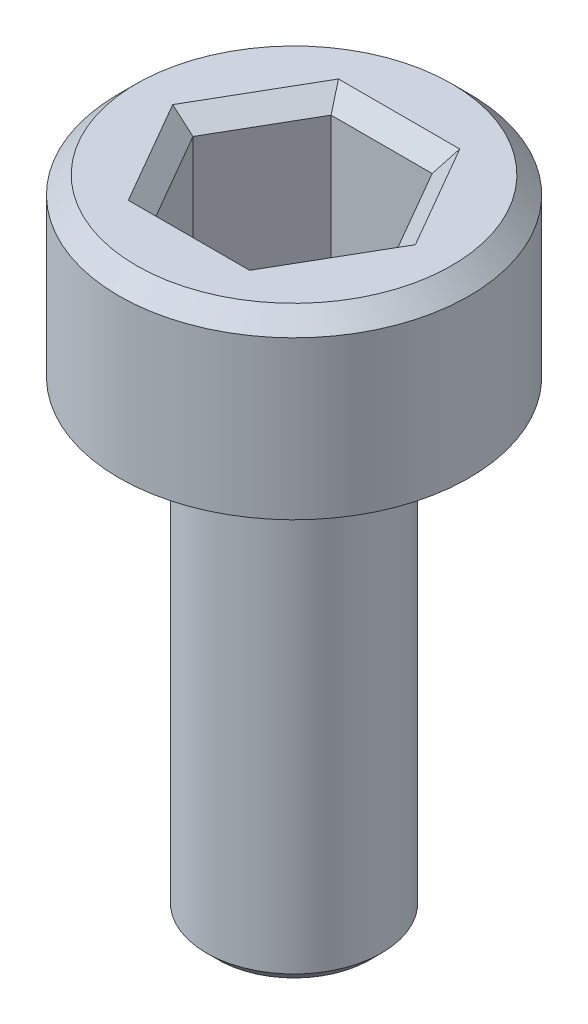
ISO-10303-21;
HEADER;
FILE_DESCRIPTION(('STEP AP214'),'2;1');
FILE_NAME('part.step','',(''),(''),'','','');
FILE_SCHEMA(('AUTOMOTIVE_DESIGN { 1 0 10303 214 1 1 1 1 }'));
ENDSEC;
DATA;
#1=APPLICATION_CONTEXT('core data for automotive mechanical design processes');
#2=APPLICATION_PROTOCOL_DEFINITION('international standard','automotive_design',2000,#1);
#3=PRODUCT_CONTEXT('',#1,'mechanical');
#4=PRODUCT('Part','Part','',(#3));
#5=PRODUCT_RELATED_PRODUCT_CATEGORY('part','',(#4));
#6=PRODUCT_DEFINITION_FORMATION('','',#4);
#7=PRODUCT_DEFINITION_CONTEXT('part definition',#1,'design');
#8=PRODUCT_DEFINITION('design','',#6,#7);
#9=PRODUCT_DEFINITION_SHAPE('','',#8);
#10=(LENGTH_UNIT() NAMED_UNIT(*) SI_UNIT(.MILLI.,.METRE.));
#11=(NAMED_UNIT(*) PLANE_ANGLE_UNIT() SI_UNIT($,.RADIAN.));
#12=(NAMED_UNIT(*) SI_UNIT($,.STERADIAN.) SOLID_ANGLE_UNIT());
#13=UNCERTAINTY_MEASURE_WITH_UNIT(LENGTH_MEASURE(1.E-05),#10,'distance_accuracy_value','');
#14=(GEOMETRIC_REPRESENTATION_CONTEXT(3) GLOBAL_UNCERTAINTY_ASSIGNED_CONTEXT((#13)) GLOBAL_UNIT_ASSIGNED_CONTEXT((#10,
#11,#12)) REPRESENTATION_CONTEXT('',''));
#15=CARTESIAN_POINT('',(0.,0.,0.));
#16=DIRECTION('',(0.,0.,1.));
#17=DIRECTION('',(1.,0.,0.));
#18=AXIS2_PLACEMENT_3D('',#15,#16,#17);
#19=CARTESIAN_POINT('',(0.,0.,0.));
#20=DIRECTION('',(0.,1.,0.));
#21=DIRECTION('',(0.,0.,1.));
#22=AXIS2_PLACEMENT_3D('',#19,#20,#21);
#23=PLANE('',#22);
#24=CARTESIAN_POINT('',(0.,0.,0.));
#25=DIRECTION('',(0.,1.,0.));
#26=DIRECTION('',(0.,0.,1.));
#27=AXIS2_PLACEMENT_3D('',#24,#25,#26);
#28=CIRCLE('',#27,3.);
#29=CARTESIAN_POINT('',(0.,0.,3.));
#30=VERTEX_POINT('',#29);
#31=EDGE_CURVE('E146',#30,#30,#28,.T.);
#32=ORIENTED_EDGE('',*,*,#31,.F.);
#33=EDGE_LOOP('',(#32));
#34=FACE_BOUND('',#33,.T.);
#35=CARTESIAN_POINT('',(0.,0.,0.));
#36=DIRECTION('',(0.,1.,0.));
#37=DIRECTION('',(0.,0.,1.));
#38=AXIS2_PLACEMENT_3D('',#35,#36,#37);
#39=CIRCLE('',#38,1.5);
#40=CARTESIAN_POINT('',(0.,0.,1.5));
#41=VERTEX_POINT('',#40);
#42=EDGE_CURVE('E185',#41,#41,#39,.F.);
#43=ORIENTED_EDGE('',*,*,#42,.F.);
#44=EDGE_LOOP('',(#43));
#45=FACE_BOUND('',#44,.T.);
#46=ADVANCED_FACE('F33',(#34,#45),#23,.F.);
#47=CARTESIAN_POINT('',(0.,3.,0.));
#48=DIRECTION('',(0.,-1.,0.));
#49=DIRECTION('',(0.,0.,-1.));
#50=AXIS2_PLACEMENT_3D('',#47,#48,#49);
#51=CYLINDRICAL_SURFACE('',#50,3.);
#52=CARTESIAN_POINT('',(0.,2.7,0.));
#53=DIRECTION('',(0.,1.,0.));
#54=DIRECTION('',(0.,0.,1.));
#55=AXIS2_PLACEMENT_3D('',#52,#53,#54);
#56=CIRCLE('',#55,3.);
#57=CARTESIAN_POINT('',(0.,2.7,3.));
#58=VERTEX_POINT('',#57);
#59=EDGE_CURVE('E160',#58,#58,#56,.F.);
#60=ORIENTED_EDGE('',*,*,#59,.T.);
#61=EDGE_LOOP('',(#60));
#62=FACE_BOUND('',#61,.T.);
#63=ORIENTED_EDGE('',*,*,#31,.T.);
#64=EDGE_LOOP('',(#63));
#65=FACE_BOUND('',#64,.T.);
#66=ADVANCED_FACE('F213',(#62,#65),#51,.T.);
#67=CARTESIAN_POINT('',(0.,3.,0.));
#68=DIRECTION('',(0.,1.,0.));
#69=DIRECTION('',(0.,0.,1.));
#70=AXIS2_PLACEMENT_3D('',#67,#68,#69);
#71=PLANE('',#70);
#72=DIRECTION('',(1.,0.,0.));
#73=VECTOR('',#72,1.);
#74=CARTESIAN_POINT('',(0.866025403784439,3.,-1.8));
#75=LINE('',#74,#73);
#76=CARTESIAN_POINT('',(-1.03923048454133,3.,-1.8));
#77=VERTEX_POINT('',#76);
#78=CARTESIAN_POINT('',(1.03923048454133,3.,-1.8));
#79=VERTEX_POINT('',#78);
#80=EDGE_CURVE('E165',#77,#79,#75,.T.);
#81=ORIENTED_EDGE('',*,*,#80,.T.);
#82=DIRECTION('',(0.5,0.,0.866025403784439));
#83=VECTOR('',#82,1.);
#84=CARTESIAN_POINT('',(1.99185842870421,3.,-0.150000000000001));
#85=LINE('',#84,#83);
#86=CARTESIAN_POINT('',(2.07846096908265,3.,0.));
#87=VERTEX_POINT('',#86);
#88=EDGE_CURVE('E175',#79,#87,#85,.T.);
#89=ORIENTED_EDGE('',*,*,#88,.T.);
#90=DIRECTION('',(-0.5,0.,0.866025403784439));
#91=VECTOR('',#90,1.);
#92=CARTESIAN_POINT('',(1.12583302491977,3.,1.65));
#93=LINE('',#92,#91);
#94=CARTESIAN_POINT('',(1.03923048454133,3.,1.8));
#95=VERTEX_POINT('',#94);
#96=EDGE_CURVE('E173',#87,#95,#93,.T.);
#97=ORIENTED_EDGE('',*,*,#96,.T.);
#98=DIRECTION('',(-1.,0.,0.));
#99=VECTOR('',#98,1.);
#100=CARTESIAN_POINT('',(-0.866025403784438,3.,1.8));
#101=LINE('',#100,#99);
#102=CARTESIAN_POINT('',(-1.03923048454133,3.,1.8));
#103=VERTEX_POINT('',#102);
#104=EDGE_CURVE('E171',#95,#103,#101,.T.);
#105=ORIENTED_EDGE('',*,*,#104,.T.);
#106=DIRECTION('',(-0.5,0.,-0.866025403784439));
#107=VECTOR('',#106,1.);
#108=CARTESIAN_POINT('',(-1.99185842870421,3.,0.150000000000001));
#109=LINE('',#108,#107);
#110=CARTESIAN_POINT('',(-2.07846096908265,3.,0.));
#111=VERTEX_POINT('',#110);
#112=EDGE_CURVE('E169',#103,#111,#109,.T.);
#113=ORIENTED_EDGE('',*,*,#112,.T.);
#114=DIRECTION('',(0.5,0.,-0.866025403784439));
#115=VECTOR('',#114,1.);
#116=CARTESIAN_POINT('',(-1.12583302491977,3.,-1.65));
#117=LINE('',#116,#115);
#118=EDGE_CURVE('E167',#111,#77,#117,.T.);
#119=ORIENTED_EDGE('',*,*,#118,.T.);
#120=EDGE_LOOP('',(#81,#89,#97,#105,#113,#119));
#121=FACE_BOUND('',#120,.T.);
#122=CARTESIAN_POINT('',(0.,3.,0.));
#123=DIRECTION('',(0.,1.,0.));
#124=DIRECTION('',(0.,0.,1.));
#125=AXIS2_PLACEMENT_3D('',#122,#123,#124);
#126=CIRCLE('',#125,2.7);
#127=CARTESIAN_POINT('',(0.,3.,2.7));
#128=VERTEX_POINT('',#127);
#129=EDGE_CURVE('E157',#128,#128,#126,.T.);
#130=ORIENTED_EDGE('',*,*,#129,.T.);
#131=EDGE_LOOP('',(#130));
#132=FACE_BOUND('',#131,.T.);
#133=ADVANCED_FACE('F219',(#121,#132),#71,.T.);
#134=CARTESIAN_POINT('',(0.,3.,0.));
#135=DIRECTION('',(0.,-1.,0.));
#136=DIRECTION('',(0.,0.,-1.));
#137=AXIS2_PLACEMENT_3D('',#134,#135,#136);
#138=CONICAL_SURFACE('',#137,2.7,0.785398163397448);
#139=ORIENTED_EDGE('',*,*,#59,.F.);
#140=EDGE_LOOP('',(#139));
#141=FACE_BOUND('',#140,.T.);
#142=ORIENTED_EDGE('',*,*,#129,.F.);
#143=EDGE_LOOP('',(#142));
#144=FACE_BOUND('',#143,.T.);
#145=ADVANCED_FACE('F227',(#141,#144),#138,.T.);
#146=CARTESIAN_POINT('',(0.866025403784439,0.5,1.5));
#147=DIRECTION('',(0.866025403784439,0.,0.5));
#148=DIRECTION('',(0.5,0.,-0.866025403784439));
#149=AXIS2_PLACEMENT_3D('',#146,#147,#148);
#150=PLANE('',#149);
#151=DIRECTION('',(0.,1.,0.));
#152=VECTOR('',#151,1.);
#153=CARTESIAN_POINT('',(0.866025403784439,0.5,1.5));
#154=LINE('',#153,#152);
#155=CARTESIAN_POINT('',(0.866025403784439,0.5,1.5));
#156=VERTEX_POINT('',#155);
#157=CARTESIAN_POINT('',(0.866025403784439,2.7,1.5));
#158=VERTEX_POINT('',#157);
#159=EDGE_CURVE('E144',#156,#158,#154,.T.);
#160=ORIENTED_EDGE('',*,*,#159,.T.);
#161=DIRECTION('',(0.5,0.,-0.866025403784439));
#162=VECTOR('',#161,1.);
#163=CARTESIAN_POINT('',(1.73205080756888,2.7,0.));
#164=LINE('',#163,#162);
#165=CARTESIAN_POINT('',(1.73205080756888,2.7,0.));
#166=VERTEX_POINT('',#165);
#167=EDGE_CURVE('E113',#158,#166,#164,.T.);
#168=ORIENTED_EDGE('',*,*,#167,.T.);
#169=DIRECTION('',(0.,1.,0.));
#170=VECTOR('',#169,1.);
#171=CARTESIAN_POINT('',(1.73205080756888,0.5,0.));
#172=LINE('',#171,#170);
#173=CARTESIAN_POINT('',(1.73205080756888,0.5,0.));
#174=VERTEX_POINT('',#173);
#175=EDGE_CURVE('E105',#174,#166,#172,.T.);
#176=ORIENTED_EDGE('',*,*,#175,.F.);
#177=DIRECTION('',(0.5,0.,-0.866025403784439));
#178=VECTOR('',#177,1.);
#179=CARTESIAN_POINT('',(0.866025403784439,0.5,1.5));
#180=LINE('',#179,#178);
#181=EDGE_CURVE('E110',#156,#174,#180,.T.);
#182=ORIENTED_EDGE('',*,*,#181,.F.);
#183=EDGE_LOOP('',(#160,#168,#176,#182));
#184=FACE_BOUND('',#183,.T.);
#185=ADVANCED_FACE('F108',(#184),#150,.F.);
#186=CARTESIAN_POINT('',(-0.866025403784438,0.5,1.5));
#187=DIRECTION('',(0.,0.,1.));
#188=DIRECTION('',(1.,0.,0.));
#189=AXIS2_PLACEMENT_3D('',#186,#187,#188);
#190=PLANE('',#189);
#191=DIRECTION('',(0.,1.,0.));
#192=VECTOR('',#191,1.);
#193=CARTESIAN_POINT('',(-0.866025403784438,0.5,1.5));
#194=LINE('',#193,#192);
#195=CARTESIAN_POINT('',(-0.866025403784438,0.5,1.5));
#196=VERTEX_POINT('',#195);
#197=CARTESIAN_POINT('',(-0.866025403784438,2.7,1.5));
#198=VERTEX_POINT('',#197);
#199=EDGE_CURVE('E147',#196,#198,#194,.T.);
#200=ORIENTED_EDGE('',*,*,#199,.T.);
#201=DIRECTION('',(1.,0.,0.));
#202=VECTOR('',#201,1.);
#203=CARTESIAN_POINT('',(0.866025403784439,2.7,1.5));
#204=LINE('',#203,#202);
#205=EDGE_CURVE('E179',#198,#158,#204,.T.);
#206=ORIENTED_EDGE('',*,*,#205,.T.);
#207=ORIENTED_EDGE('',*,*,#159,.F.);
#208=DIRECTION('',(1.,0.,0.));
#209=VECTOR('',#208,1.);
#210=CARTESIAN_POINT('',(-0.866025403784438,0.5,1.5));
#211=LINE('',#210,#209);
#212=EDGE_CURVE('E118',#196,#156,#211,.T.);
#213=ORIENTED_EDGE('',*,*,#212,.F.);
#214=EDGE_LOOP('',(#200,#206,#207,#213));
#215=FACE_BOUND('',#214,.T.);
#216=ADVANCED_FACE('F280',(#215),#190,.F.);
#217=CARTESIAN_POINT('',(-1.73205080756888,0.5,0.));
#218=DIRECTION('',(-0.866025403784438,0.,0.5));
#219=DIRECTION('',(0.5,0.,0.866025403784439));
#220=AXIS2_PLACEMENT_3D('',#217,#218,#219);
#221=PLANE('',#220);
#222=DIRECTION('',(0.,1.,0.));
#223=VECTOR('',#222,1.);
#224=CARTESIAN_POINT('',(-1.73205080756888,0.5,0.));
#225=LINE('',#224,#223);
#226=CARTESIAN_POINT('',(-1.73205080756888,0.5,0.));
#227=VERTEX_POINT('',#226);
#228=CARTESIAN_POINT('',(-1.73205080756888,2.7,0.));
#229=VERTEX_POINT('',#228);
#230=EDGE_CURVE('E150',#227,#229,#225,.T.);
#231=ORIENTED_EDGE('',*,*,#230,.T.);
#232=DIRECTION('',(0.5,0.,0.866025403784439));
#233=VECTOR('',#232,1.);
#234=CARTESIAN_POINT('',(-0.866025403784438,2.7,1.5));
#235=LINE('',#234,#233);
#236=EDGE_CURVE('E181',#229,#198,#235,.T.);
#237=ORIENTED_EDGE('',*,*,#236,.T.);
#238=ORIENTED_EDGE('',*,*,#199,.F.);
#239=DIRECTION('',(0.5,0.,0.866025403784439));
#240=VECTOR('',#239,1.);
#241=CARTESIAN_POINT('',(-1.73205080756888,0.5,0.));
#242=LINE('',#241,#240);
#243=EDGE_CURVE('E141',#227,#196,#242,.T.);
#244=ORIENTED_EDGE('',*,*,#243,.F.);
#245=EDGE_LOOP('',(#231,#237,#238,#244));
#246=FACE_BOUND('',#245,.T.);
#247=ADVANCED_FACE('F278',(#246),#221,.F.);
#248=CARTESIAN_POINT('',(-0.866025403784438,0.5,-1.5));
#249=DIRECTION('',(-0.866025403784439,0.,-0.5));
#250=DIRECTION('',(-0.5,0.,0.866025403784439));
#251=AXIS2_PLACEMENT_3D('',#248,#249,#250);
#252=PLANE('',#251);
#253=DIRECTION('',(0.,1.,0.));
#254=VECTOR('',#253,1.);
#255=CARTESIAN_POINT('',(-0.866025403784438,0.5,-1.5));
#256=LINE('',#255,#254);
#257=CARTESIAN_POINT('',(-0.866025403784438,0.5,-1.5));
#258=VERTEX_POINT('',#257);
#259=CARTESIAN_POINT('',(-0.866025403784438,2.7,-1.5));
#260=VERTEX_POINT('',#259);
#261=EDGE_CURVE('E152',#258,#260,#256,.T.);
#262=ORIENTED_EDGE('',*,*,#261,.T.);
#263=DIRECTION('',(-0.5,0.,0.866025403784439));
#264=VECTOR('',#263,1.);
#265=CARTESIAN_POINT('',(-1.73205080756888,2.7,0.));
#266=LINE('',#265,#264);
#267=EDGE_CURVE('E55',#260,#229,#266,.T.);
#268=ORIENTED_EDGE('',*,*,#267,.T.);
#269=ORIENTED_EDGE('',*,*,#230,.F.);
#270=DIRECTION('',(-0.5,0.,0.866025403784439));
#271=VECTOR('',#270,1.);
#272=CARTESIAN_POINT('',(-0.866025403784438,0.5,-1.5));
#273=LINE('',#272,#271);
#274=EDGE_CURVE('E138',#258,#227,#273,.T.);
#275=ORIENTED_EDGE('',*,*,#274,.F.);
#276=EDGE_LOOP('',(#262,#268,#269,#275));
#277=FACE_BOUND('',#276,.T.);
#278=ADVANCED_FACE('F276',(#277),#252,.F.);
#279=CARTESIAN_POINT('',(0.866025403784439,0.5,-1.5));
#280=DIRECTION('',(0.,0.,-1.));
#281=DIRECTION('',(-1.,0.,0.));
#282=AXIS2_PLACEMENT_3D('',#279,#280,#281);
#283=PLANE('',#282);
#284=DIRECTION('',(0.,1.,0.));
#285=VECTOR('',#284,1.);
#286=CARTESIAN_POINT('',(0.866025403784439,0.5,-1.5));
#287=LINE('',#286,#285);
#288=CARTESIAN_POINT('',(0.866025403784439,0.5,-1.5));
#289=VERTEX_POINT('',#288);
#290=CARTESIAN_POINT('',(0.866025403784439,2.7,-1.5));
#291=VERTEX_POINT('',#290);
#292=EDGE_CURVE('E117',#289,#291,#287,.T.);
#293=ORIENTED_EDGE('',*,*,#292,.T.);
#294=DIRECTION('',(-1.,0.,0.));
#295=VECTOR('',#294,1.);
#296=CARTESIAN_POINT('',(-0.866025403784438,2.7,-1.5));
#297=LINE('',#296,#295);
#298=EDGE_CURVE('E48',#291,#260,#297,.T.);
#299=ORIENTED_EDGE('',*,*,#298,.T.);
#300=ORIENTED_EDGE('',*,*,#261,.F.);
#301=DIRECTION('',(-1.,0.,0.));
#302=VECTOR('',#301,1.);
#303=CARTESIAN_POINT('',(0.866025403784439,0.5,-1.5));
#304=LINE('',#303,#302);
#305=EDGE_CURVE('E126',#289,#258,#304,.T.);
#306=ORIENTED_EDGE('',*,*,#305,.F.);
#307=EDGE_LOOP('',(#293,#299,#300,#306));
#308=FACE_BOUND('',#307,.T.);
#309=ADVANCED_FACE('F273',(#308),#283,.F.);
#310=CARTESIAN_POINT('',(1.73205080756888,0.5,0.));
#311=DIRECTION('',(0.866025403784438,0.,-0.5));
#312=DIRECTION('',(-0.5,0.,-0.866025403784438));
#313=AXIS2_PLACEMENT_3D('',#310,#311,#312);
#314=PLANE('',#313);
#315=ORIENTED_EDGE('',*,*,#175,.T.);
#316=DIRECTION('',(-0.5,0.,-0.866025403784438));
#317=VECTOR('',#316,1.);
#318=CARTESIAN_POINT('',(0.866025403784439,2.7,-1.5));
#319=LINE('',#318,#317);
#320=EDGE_CURVE('E163',#166,#291,#319,.T.);
#321=ORIENTED_EDGE('',*,*,#320,.T.);
#322=ORIENTED_EDGE('',*,*,#292,.F.);
#323=DIRECTION('',(-0.5,0.,-0.866025403784438));
#324=VECTOR('',#323,1.);
#325=CARTESIAN_POINT('',(1.73205080756888,0.5,0.));
#326=LINE('',#325,#324);
#327=EDGE_CURVE('E121',#174,#289,#326,.T.);
#328=ORIENTED_EDGE('',*,*,#327,.F.);
#329=EDGE_LOOP('',(#315,#321,#322,#328));
#330=FACE_BOUND('',#329,.T.);
#331=ADVANCED_FACE('F122',(#330),#314,.F.);
#332=CARTESIAN_POINT('',(0.,0.5,0.));
#333=DIRECTION('',(0.,1.,0.));
#334=DIRECTION('',(0.,0.,1.));
#335=AXIS2_PLACEMENT_3D('',#332,#333,#334);
#336=PLANE('',#335);
#337=ORIENTED_EDGE('',*,*,#181,.T.);
#338=ORIENTED_EDGE('',*,*,#327,.T.);
#339=ORIENTED_EDGE('',*,*,#305,.T.);
#340=ORIENTED_EDGE('',*,*,#274,.T.);
#341=ORIENTED_EDGE('',*,*,#243,.T.);
#342=ORIENTED_EDGE('',*,*,#212,.T.);
#343=EDGE_LOOP('',(#337,#338,#339,#340,#341,#342));
#344=FACE_BOUND('',#343,.T.);
#345=ADVANCED_FACE('F128',(#344),#336,.T.);
#346=CARTESIAN_POINT('',(-1.73205080756888,2.7,0.));
#347=DIRECTION('',(0.612372435695794,0.707106781186548,-0.353553390593273));
#348=DIRECTION('',(-0.5,0.,-0.866025403784439));
#349=AXIS2_PLACEMENT_3D('',#346,#347,#348);
#350=PLANE('',#349);
#351=DIRECTION('',(0.755928946018455,-0.654653670707976,0.));
#352=VECTOR('',#351,1.);
#353=CARTESIAN_POINT('',(-1.73205080756888,2.7,0.));
#354=LINE('',#353,#352);
#355=EDGE_CURVE('E134',#111,#229,#354,.T.);
#356=ORIENTED_EDGE('',*,*,#355,.F.);
#357=ORIENTED_EDGE('',*,*,#112,.F.);
#358=DIRECTION('',(0.377964473009228,-0.654653670707976,-0.654653670707978));
#359=VECTOR('',#358,1.);
#360=CARTESIAN_POINT('',(-0.866025403784438,2.7,1.5));
#361=LINE('',#360,#359);
#362=EDGE_CURVE('E131',#198,#103,#361,.F.);
#363=ORIENTED_EDGE('',*,*,#362,.F.);
#364=ORIENTED_EDGE('',*,*,#236,.F.);
#365=EDGE_LOOP('',(#356,#357,#363,#364));
#366=FACE_BOUND('',#365,.T.);
#367=ADVANCED_FACE('F249',(#366),#350,.T.);
#368=CARTESIAN_POINT('',(-0.866025403784438,2.7,1.5));
#369=DIRECTION('',(0.,0.707106781186548,-0.707106781186547));
#370=DIRECTION('',(-1.,0.,0.));
#371=AXIS2_PLACEMENT_3D('',#368,#369,#370);
#372=PLANE('',#371);
#373=ORIENTED_EDGE('',*,*,#362,.T.);
#374=ORIENTED_EDGE('',*,*,#104,.F.);
#375=DIRECTION('',(-0.377964473009228,-0.654653670707976,-0.654653670707978));
#376=VECTOR('',#375,1.);
#377=CARTESIAN_POINT('',(0.866025403784439,2.7,1.5));
#378=LINE('',#377,#376);
#379=EDGE_CURVE('E193',#158,#95,#378,.F.);
#380=ORIENTED_EDGE('',*,*,#379,.F.);
#381=ORIENTED_EDGE('',*,*,#205,.F.);
#382=EDGE_LOOP('',(#373,#374,#380,#381));
#383=FACE_BOUND('',#382,.T.);
#384=ADVANCED_FACE('F246',(#383),#372,.T.);
#385=CARTESIAN_POINT('',(-0.866025403784438,2.7,-1.5));
#386=DIRECTION('',(0.612372435695794,0.707106781186549,0.353553390593273));
#387=DIRECTION('',(0.5,0.,-0.866025403784439));
#388=AXIS2_PLACEMENT_3D('',#385,#386,#387);
#389=PLANE('',#388);
#390=ORIENTED_EDGE('',*,*,#355,.T.);
#391=ORIENTED_EDGE('',*,*,#267,.F.);
#392=DIRECTION('',(0.377964473009228,-0.654653670707976,0.654653670707978));
#393=VECTOR('',#392,1.);
#394=CARTESIAN_POINT('',(-0.866025403784438,2.7,-1.5));
#395=LINE('',#394,#393);
#396=EDGE_CURVE('E190',#77,#260,#395,.T.);
#397=ORIENTED_EDGE('',*,*,#396,.F.);
#398=ORIENTED_EDGE('',*,*,#118,.F.);
#399=EDGE_LOOP('',(#390,#391,#397,#398));
#400=FACE_BOUND('',#399,.T.);
#401=ADVANCED_FACE('F242',(#400),#389,.T.);
#402=CARTESIAN_POINT('',(0.866025403784439,2.7,1.5));
#403=DIRECTION('',(-0.612372435695794,0.707106781186549,-0.353553390593273));
#404=DIRECTION('',(-0.5,0.,0.866025403784439));
#405=AXIS2_PLACEMENT_3D('',#402,#403,#404);
#406=PLANE('',#405);
#407=ORIENTED_EDGE('',*,*,#379,.T.);
#408=ORIENTED_EDGE('',*,*,#96,.F.);
#409=DIRECTION('',(-0.755928946018455,-0.654653670707976,0.));
#410=VECTOR('',#409,1.);
#411=CARTESIAN_POINT('',(1.73205080756888,2.7,0.));
#412=LINE('',#411,#410);
#413=EDGE_CURVE('E188',#166,#87,#412,.F.);
#414=ORIENTED_EDGE('',*,*,#413,.F.);
#415=ORIENTED_EDGE('',*,*,#167,.F.);
#416=EDGE_LOOP('',(#407,#408,#414,#415));
#417=FACE_BOUND('',#416,.T.);
#418=ADVANCED_FACE('F238',(#417),#406,.T.);
#419=CARTESIAN_POINT('',(0.866025403784439,2.7,-1.5));
#420=DIRECTION('',(0.,0.707106781186549,0.707106781186547));
#421=DIRECTION('',(1.,0.,0.));
#422=AXIS2_PLACEMENT_3D('',#419,#420,#421);
#423=PLANE('',#422);
#424=ORIENTED_EDGE('',*,*,#396,.T.);
#425=ORIENTED_EDGE('',*,*,#298,.F.);
#426=DIRECTION('',(0.377964473009228,0.654653670707976,-0.654653670707978));
#427=VECTOR('',#426,1.);
#428=CARTESIAN_POINT('',(0.618589574131741,2.27142857142857,-1.07142857142857));
#429=LINE('',#428,#427);
#430=EDGE_CURVE('E186',#79,#291,#429,.F.);
#431=ORIENTED_EDGE('',*,*,#430,.F.);
#432=ORIENTED_EDGE('',*,*,#80,.F.);
#433=EDGE_LOOP('',(#424,#425,#431,#432));
#434=FACE_BOUND('',#433,.T.);
#435=ADVANCED_FACE('F234',(#434),#423,.T.);
#436=CARTESIAN_POINT('',(1.73205080756888,2.7,0.));
#437=DIRECTION('',(-0.612372435695793,0.707106781186549,0.353553390593273));
#438=DIRECTION('',(0.5,0.,0.866025403784438));
#439=AXIS2_PLACEMENT_3D('',#436,#437,#438);
#440=PLANE('',#439);
#441=ORIENTED_EDGE('',*,*,#413,.T.);
#442=ORIENTED_EDGE('',*,*,#88,.F.);
#443=ORIENTED_EDGE('',*,*,#430,.T.);
#444=ORIENTED_EDGE('',*,*,#320,.F.);
#445=EDGE_LOOP('',(#441,#442,#443,#444));
#446=FACE_BOUND('',#445,.T.);
#447=ADVANCED_FACE('F231',(#446),#440,.T.);
#448=CARTESIAN_POINT('',(0.,-8.,0.));
#449=DIRECTION('',(0.,1.,0.));
#450=DIRECTION('',(0.,0.,1.));
#451=AXIS2_PLACEMENT_3D('',#448,#449,#450);
#452=CYLINDRICAL_SURFACE('',#451,1.5);
#453=CARTESIAN_POINT('',(0.,-7.8,0.));
#454=DIRECTION('',(0.,-1.,0.));
#455=DIRECTION('',(0.,0.,-1.));
#456=AXIS2_PLACEMENT_3D('',#453,#454,#455);
#457=CIRCLE('',#456,1.5);
#458=CARTESIAN_POINT('',(0.,-7.8,-1.5));
#459=VERTEX_POINT('',#458);
#460=EDGE_CURVE('E11',#459,#459,#457,.F.);
#461=ORIENTED_EDGE('',*,*,#460,.T.);
#462=EDGE_LOOP('',(#461));
#463=FACE_BOUND('',#462,.T.);
#464=ORIENTED_EDGE('',*,*,#42,.T.);
#465=EDGE_LOOP('',(#464));
#466=FACE_BOUND('',#465,.T.);
#467=ADVANCED_FACE('F209',(#463,#466),#452,.T.);
#468=CARTESIAN_POINT('',(0.,-8.,0.));
#469=DIRECTION('',(0.,-1.,0.));
#470=DIRECTION('',(0.,0.,-1.));
#471=AXIS2_PLACEMENT_3D('',#468,#469,#470);
#472=PLANE('',#471);
#473=CARTESIAN_POINT('',(0.,-8.,0.));
#474=DIRECTION('',(0.,-1.,0.));
#475=DIRECTION('',(0.,0.,-1.));
#476=AXIS2_PLACEMENT_3D('',#473,#474,#475);
#477=CIRCLE('',#476,1.3);
#478=CARTESIAN_POINT('',(0.,-8.,-1.3));
#479=VERTEX_POINT('',#478);
#480=EDGE_CURVE('E41',#479,#479,#477,.T.);
#481=ORIENTED_EDGE('',*,*,#480,.T.);
#482=EDGE_LOOP('',(#481));
#483=FACE_BOUND('',#482,.T.);
#484=ADVANCED_FACE('F202',(#483),#472,.T.);
#485=CARTESIAN_POINT('',(0.,-8.,0.));
#486=DIRECTION('',(0.,1.,0.));
#487=DIRECTION('',(0.,0.,1.));
#488=AXIS2_PLACEMENT_3D('',#485,#486,#487);
#489=CONICAL_SURFACE('',#488,1.3,0.785398163397446);
#490=ORIENTED_EDGE('',*,*,#460,.F.);
#491=EDGE_LOOP('',(#490));
#492=FACE_BOUND('',#491,.T.);
#493=ORIENTED_EDGE('',*,*,#480,.F.);
#494=EDGE_LOOP('',(#493));
#495=FACE_BOUND('',#494,.T.);
#496=ADVANCED_FACE('F35',(#492,#495),#489,.T.);
#497=CLOSED_SHELL('',(#46,#66,#133,#145,#185,#216,#247,#278,#309,#331,#345,#367,#384,#401,#418,
#435,#447,#467,#484,#496));
#498=MANIFOLD_SOLID_BREP('B2',#497);
#499=ADVANCED_BREP_SHAPE_REPRESENTATION('',(#18,#498),#14);
#500=SHAPE_DEFINITION_REPRESENTATION(#9,#499);
ENDSEC;
END-ISO-10303-21;
